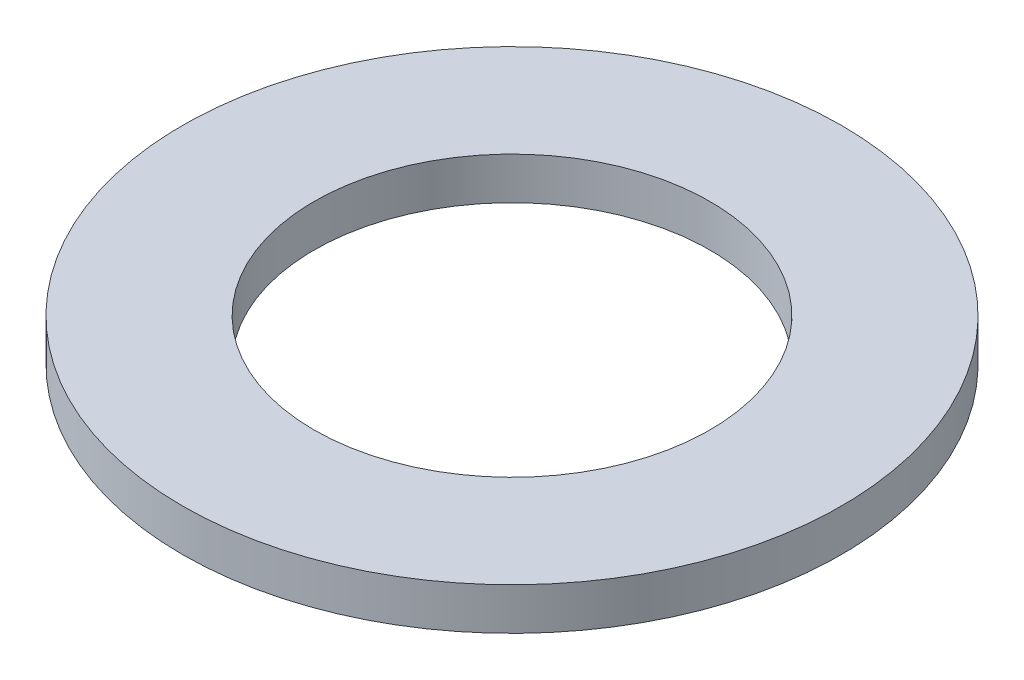
ISO-10303-21;
HEADER;
FILE_DESCRIPTION(('STEP AP214'),'2;1');
FILE_NAME('part.step','',(''),(''),'','','');
FILE_SCHEMA(('AUTOMOTIVE_DESIGN { 1 0 10303 214 1 1 1 1 }'));
ENDSEC;
DATA;
#1=APPLICATION_CONTEXT('core data for automotive mechanical design processes');
#2=APPLICATION_PROTOCOL_DEFINITION('international standard','automotive_design',2000,#1);
#3=PRODUCT_CONTEXT('',#1,'mechanical');
#4=PRODUCT('Part','Part','',(#3));
#5=PRODUCT_RELATED_PRODUCT_CATEGORY('part','',(#4));
#6=PRODUCT_DEFINITION_FORMATION('','',#4);
#7=PRODUCT_DEFINITION_CONTEXT('part definition',#1,'design');
#8=PRODUCT_DEFINITION('design','',#6,#7);
#9=PRODUCT_DEFINITION_SHAPE('','',#8);
#10=(LENGTH_UNIT() NAMED_UNIT(*) SI_UNIT(.MILLI.,.METRE.));
#11=(NAMED_UNIT(*) PLANE_ANGLE_UNIT() SI_UNIT($,.RADIAN.));
#12=(NAMED_UNIT(*) SI_UNIT($,.STERADIAN.) SOLID_ANGLE_UNIT());
#13=UNCERTAINTY_MEASURE_WITH_UNIT(LENGTH_MEASURE(1.E-05),#10,'distance_accuracy_value','');
#14=(GEOMETRIC_REPRESENTATION_CONTEXT(3) GLOBAL_UNCERTAINTY_ASSIGNED_CONTEXT((#13)) GLOBAL_UNIT_ASSIGNED_CONTEXT((#10,
#11,#12)) REPRESENTATION_CONTEXT('',''));
#15=CARTESIAN_POINT('',(0.,0.,0.));
#16=DIRECTION('',(0.,0.,1.));
#17=DIRECTION('',(1.,0.,0.));
#18=AXIS2_PLACEMENT_3D('',#15,#16,#17);
#19=CARTESIAN_POINT('',(0.,0.508,0.));
#20=DIRECTION('',(0.,1.,0.));
#21=DIRECTION('',(0.,0.,1.));
#22=AXIS2_PLACEMENT_3D('',#19,#20,#21);
#23=PLANE('',#22);
#24=CARTESIAN_POINT('',(0.,0.508,0.));
#25=DIRECTION('',(0.,1.,0.));
#26=DIRECTION('',(0.,0.,1.));
#27=AXIS2_PLACEMENT_3D('',#24,#25,#26);
#28=CIRCLE('',#27,3.9751);
#29=CARTESIAN_POINT('',(0.,0.508,3.9751));
#30=VERTEX_POINT('',#29);
#31=EDGE_CURVE('E10',#30,#30,#28,.T.);
#32=ORIENTED_EDGE('',*,*,#31,.T.);
#33=EDGE_LOOP('',(#32));
#34=FACE_BOUND('',#33,.T.);
#35=CARTESIAN_POINT('',(0.,0.508,0.));
#36=DIRECTION('',(0.,1.,0.));
#37=DIRECTION('',(0.,0.,1.));
#38=AXIS2_PLACEMENT_3D('',#35,#36,#37);
#39=CIRCLE('',#38,2.3876);
#40=CARTESIAN_POINT('',(0.,0.508,2.3876));
#41=VERTEX_POINT('',#40);
#42=EDGE_CURVE('E39',#41,#41,#39,.T.);
#43=ORIENTED_EDGE('',*,*,#42,.F.);
#44=EDGE_LOOP('',(#43));
#45=FACE_BOUND('',#44,.T.);
#46=ADVANCED_FACE('F28',(#34,#45),#23,.T.);
#47=CARTESIAN_POINT('',(0.,0.,0.));
#48=DIRECTION('',(0.,1.,0.));
#49=DIRECTION('',(0.,0.,1.));
#50=AXIS2_PLACEMENT_3D('',#47,#48,#49);
#51=PLANE('',#50);
#52=CARTESIAN_POINT('',(0.,0.,0.));
#53=DIRECTION('',(0.,1.,0.));
#54=DIRECTION('',(0.,0.,1.));
#55=AXIS2_PLACEMENT_3D('',#52,#53,#54);
#56=CIRCLE('',#55,3.9751);
#57=CARTESIAN_POINT('',(0.,0.,3.9751));
#58=VERTEX_POINT('',#57);
#59=EDGE_CURVE('E32',#58,#58,#56,.T.);
#60=ORIENTED_EDGE('',*,*,#59,.F.);
#61=EDGE_LOOP('',(#60));
#62=FACE_BOUND('',#61,.T.);
#63=CARTESIAN_POINT('',(0.,0.,0.));
#64=DIRECTION('',(0.,1.,0.));
#65=DIRECTION('',(0.,0.,1.));
#66=AXIS2_PLACEMENT_3D('',#63,#64,#65);
#67=CIRCLE('',#66,2.3876);
#68=CARTESIAN_POINT('',(0.,0.,2.3876));
#69=VERTEX_POINT('',#68);
#70=EDGE_CURVE('E41',#69,#69,#67,.T.);
#71=ORIENTED_EDGE('',*,*,#70,.T.);
#72=EDGE_LOOP('',(#71));
#73=FACE_BOUND('',#72,.T.);
#74=ADVANCED_FACE('F51',(#62,#73),#51,.F.);
#75=CARTESIAN_POINT('',(0.,0.508,0.));
#76=DIRECTION('',(0.,-1.,0.));
#77=DIRECTION('',(0.,0.,-1.));
#78=AXIS2_PLACEMENT_3D('',#75,#76,#77);
#79=CYLINDRICAL_SURFACE('',#78,3.9751);
#80=ORIENTED_EDGE('',*,*,#31,.F.);
#81=EDGE_LOOP('',(#80));
#82=FACE_BOUND('',#81,.T.);
#83=ORIENTED_EDGE('',*,*,#59,.T.);
#84=EDGE_LOOP('',(#83));
#85=FACE_BOUND('',#84,.T.);
#86=ADVANCED_FACE('F30',(#82,#85),#79,.T.);
#87=CARTESIAN_POINT('',(0.,0.508,0.));
#88=DIRECTION('',(0.,-1.,0.));
#89=DIRECTION('',(0.,0.,-1.));
#90=AXIS2_PLACEMENT_3D('',#87,#88,#89);
#91=CYLINDRICAL_SURFACE('',#90,2.3876);
#92=ORIENTED_EDGE('',*,*,#42,.T.);
#93=EDGE_LOOP('',(#92));
#94=FACE_BOUND('',#93,.T.);
#95=ORIENTED_EDGE('',*,*,#70,.F.);
#96=EDGE_LOOP('',(#95));
#97=FACE_BOUND('',#96,.T.);
#98=ADVANCED_FACE('F47',(#94,#97),#91,.F.);
#99=CLOSED_SHELL('',(#46,#74,#86,#98));
#100=MANIFOLD_SOLID_BREP('B2',#99);
#101=ADVANCED_BREP_SHAPE_REPRESENTATION('',(#18,#100),#14);
#102=SHAPE_DEFINITION_REPRESENTATION(#9,#101);
ENDSEC;
END-ISO-10303-21;
